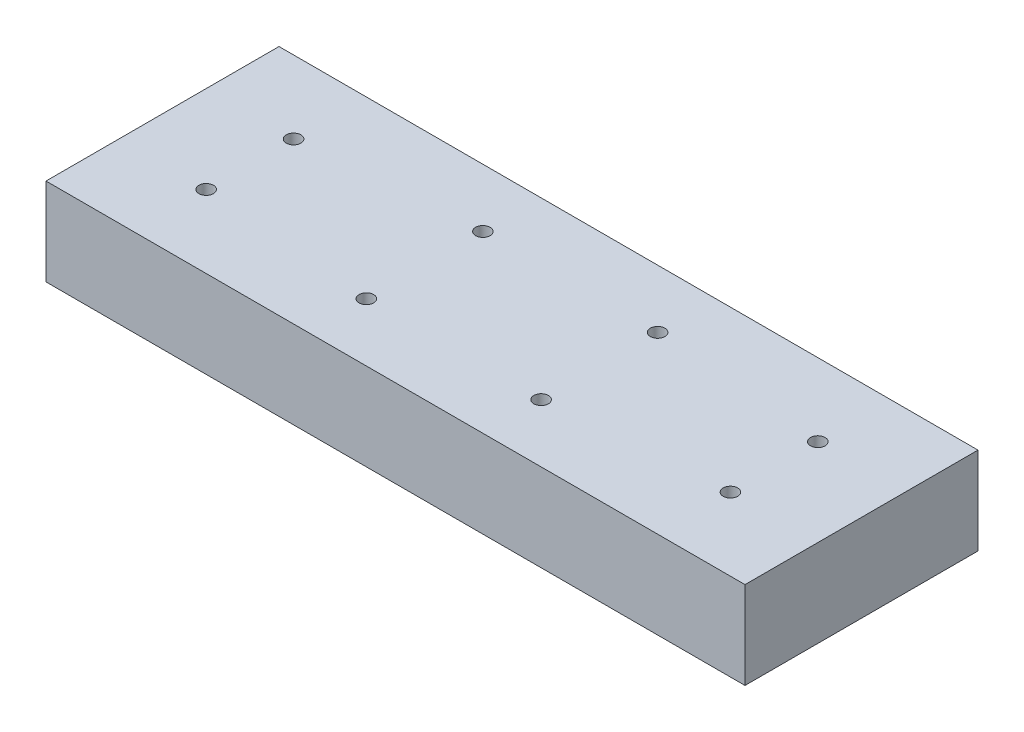
ISO-10303-21;
HEADER;
FILE_DESCRIPTION(('STEP AP214'),'2;1');
FILE_NAME('part.step','',(''),(''),'','','');
FILE_SCHEMA(('AUTOMOTIVE_DESIGN { 1 0 10303 214 1 1 1 1 }'));
ENDSEC;
DATA;
#1=APPLICATION_CONTEXT('core data for automotive mechanical design processes');
#2=APPLICATION_PROTOCOL_DEFINITION('international standard','automotive_design',2000,#1);
#3=PRODUCT_CONTEXT('',#1,'mechanical');
#4=PRODUCT('Part','Part','',(#3));
#5=PRODUCT_RELATED_PRODUCT_CATEGORY('part','',(#4));
#6=PRODUCT_DEFINITION_FORMATION('','',#4);
#7=PRODUCT_DEFINITION_CONTEXT('part definition',#1,'design');
#8=PRODUCT_DEFINITION('design','',#6,#7);
#9=PRODUCT_DEFINITION_SHAPE('','',#8);
#10=(LENGTH_UNIT() NAMED_UNIT(*) SI_UNIT(.MILLI.,.METRE.));
#11=(NAMED_UNIT(*) PLANE_ANGLE_UNIT() SI_UNIT($,.RADIAN.));
#12=(NAMED_UNIT(*) SI_UNIT($,.STERADIAN.) SOLID_ANGLE_UNIT());
#13=UNCERTAINTY_MEASURE_WITH_UNIT(LENGTH_MEASURE(1.E-05),#10,'distance_accuracy_value','');
#14=(GEOMETRIC_REPRESENTATION_CONTEXT(3) GLOBAL_UNCERTAINTY_ASSIGNED_CONTEXT((#13)) GLOBAL_UNIT_ASSIGNED_CONTEXT((#10,
#11,#12)) REPRESENTATION_CONTEXT('',''));
#15=CARTESIAN_POINT('',(0.,0.,0.));
#16=DIRECTION('',(0.,0.,1.));
#17=DIRECTION('',(1.,0.,0.));
#18=AXIS2_PLACEMENT_3D('',#15,#16,#17);
#19=CARTESIAN_POINT('',(133.35,19.05,34.925));
#20=DIRECTION('',(0.,-1.,0.));
#21=DIRECTION('',(0.,0.,-1.));
#22=AXIS2_PLACEMENT_3D('',#19,#20,#21);
#23=CYLINDRICAL_SURFACE('',#22,1.58749999999996);
#24=CARTESIAN_POINT('',(133.35,19.05,34.925));
#25=DIRECTION('',(0.,1.,0.));
#26=DIRECTION('',(0.,0.,1.));
#27=AXIS2_PLACEMENT_3D('',#24,#25,#26);
#28=CIRCLE('',#27,1.58749999999996);
#29=CARTESIAN_POINT('',(133.35,19.05,36.5124999999999));
#30=VERTEX_POINT('',#29);
#31=EDGE_CURVE('E126',#30,#30,#28,.T.);
#32=ORIENTED_EDGE('',*,*,#31,.T.);
#33=EDGE_LOOP('',(#32));
#34=FACE_BOUND('',#33,.T.);
#35=CARTESIAN_POINT('',(133.35,6.35,34.925));
#36=DIRECTION('',(0.,-1.,0.));
#37=DIRECTION('',(0.,0.,-1.));
#38=AXIS2_PLACEMENT_3D('',#35,#36,#37);
#39=CIRCLE('',#38,1.58749999999996);
#40=CARTESIAN_POINT('',(133.35,6.35,33.3375));
#41=VERTEX_POINT('',#40);
#42=EDGE_CURVE('E50',#41,#41,#39,.T.);
#43=ORIENTED_EDGE('',*,*,#42,.T.);
#44=EDGE_LOOP('',(#43));
#45=FACE_BOUND('',#44,.T.);
#46=ADVANCED_FACE('F46',(#34,#45),#23,.F.);
#47=CARTESIAN_POINT('',(133.35,19.05,15.875));
#48=DIRECTION('',(0.,-1.,0.));
#49=DIRECTION('',(0.,0.,-1.));
#50=AXIS2_PLACEMENT_3D('',#47,#48,#49);
#51=CYLINDRICAL_SURFACE('',#50,1.58749999999996);
#52=CARTESIAN_POINT('',(133.35,19.05,15.875));
#53=DIRECTION('',(0.,1.,0.));
#54=DIRECTION('',(0.,0.,1.));
#55=AXIS2_PLACEMENT_3D('',#52,#53,#54);
#56=CIRCLE('',#55,1.58749999999996);
#57=CARTESIAN_POINT('',(133.35,19.05,17.4624999999999));
#58=VERTEX_POINT('',#57);
#59=EDGE_CURVE('E195',#58,#58,#56,.T.);
#60=ORIENTED_EDGE('',*,*,#59,.T.);
#61=EDGE_LOOP('',(#60));
#62=FACE_BOUND('',#61,.T.);
#63=CARTESIAN_POINT('',(133.35,6.35,15.875));
#64=DIRECTION('',(0.,-1.,0.));
#65=DIRECTION('',(0.,0.,-1.));
#66=AXIS2_PLACEMENT_3D('',#63,#64,#65);
#67=CIRCLE('',#66,1.58749999999996);
#68=CARTESIAN_POINT('',(133.35,6.35,14.2875));
#69=VERTEX_POINT('',#68);
#70=EDGE_CURVE('E152',#69,#69,#67,.T.);
#71=ORIENTED_EDGE('',*,*,#70,.T.);
#72=EDGE_LOOP('',(#71));
#73=FACE_BOUND('',#72,.T.);
#74=ADVANCED_FACE('F238',(#62,#73),#51,.F.);
#75=CARTESIAN_POINT('',(95.25,19.05,12.7));
#76=DIRECTION('',(0.,-1.,0.));
#77=DIRECTION('',(0.,0.,-1.));
#78=AXIS2_PLACEMENT_3D('',#75,#76,#77);
#79=CYLINDRICAL_SURFACE('',#78,1.5875);
#80=CARTESIAN_POINT('',(95.25,19.05,12.7));
#81=DIRECTION('',(0.,1.,0.));
#82=DIRECTION('',(0.,0.,1.));
#83=AXIS2_PLACEMENT_3D('',#80,#81,#82);
#84=CIRCLE('',#83,1.5875);
#85=CARTESIAN_POINT('',(95.25,19.05,14.2875));
#86=VERTEX_POINT('',#85);
#87=EDGE_CURVE('E207',#86,#86,#84,.T.);
#88=ORIENTED_EDGE('',*,*,#87,.T.);
#89=EDGE_LOOP('',(#88));
#90=FACE_BOUND('',#89,.T.);
#91=CARTESIAN_POINT('',(95.25,6.35,12.7));
#92=DIRECTION('',(0.,-1.,0.));
#93=DIRECTION('',(0.,0.,-1.));
#94=AXIS2_PLACEMENT_3D('',#91,#92,#93);
#95=CIRCLE('',#94,1.5875);
#96=CARTESIAN_POINT('',(95.25,6.35,11.1125));
#97=VERTEX_POINT('',#96);
#98=EDGE_CURVE('E148',#97,#97,#95,.T.);
#99=ORIENTED_EDGE('',*,*,#98,.T.);
#100=EDGE_LOOP('',(#99));
#101=FACE_BOUND('',#100,.T.);
#102=ADVANCED_FACE('F245',(#90,#101),#79,.F.);
#103=CARTESIAN_POINT('',(95.25,19.05,38.1));
#104=DIRECTION('',(0.,-1.,0.));
#105=DIRECTION('',(0.,0.,-1.));
#106=AXIS2_PLACEMENT_3D('',#103,#104,#105);
#107=CYLINDRICAL_SURFACE('',#106,1.5875);
#108=CARTESIAN_POINT('',(95.25,19.05,38.1));
#109=DIRECTION('',(0.,1.,0.));
#110=DIRECTION('',(0.,0.,1.));
#111=AXIS2_PLACEMENT_3D('',#108,#109,#110);
#112=CIRCLE('',#111,1.5875);
#113=CARTESIAN_POINT('',(95.25,19.05,39.6875));
#114=VERTEX_POINT('',#113);
#115=EDGE_CURVE('E204',#114,#114,#112,.T.);
#116=ORIENTED_EDGE('',*,*,#115,.T.);
#117=EDGE_LOOP('',(#116));
#118=FACE_BOUND('',#117,.T.);
#119=CARTESIAN_POINT('',(95.25,6.35,38.1));
#120=DIRECTION('',(0.,-1.,0.));
#121=DIRECTION('',(0.,0.,-1.));
#122=AXIS2_PLACEMENT_3D('',#119,#120,#121);
#123=CIRCLE('',#122,1.5875);
#124=CARTESIAN_POINT('',(95.25,6.35,36.5125));
#125=VERTEX_POINT('',#124);
#126=EDGE_CURVE('E143',#125,#125,#123,.T.);
#127=ORIENTED_EDGE('',*,*,#126,.T.);
#128=EDGE_LOOP('',(#127));
#129=FACE_BOUND('',#128,.T.);
#130=ADVANCED_FACE('F257',(#118,#129),#107,.F.);
#131=CARTESIAN_POINT('',(57.15,19.05,12.7));
#132=DIRECTION('',(0.,-1.,0.));
#133=DIRECTION('',(0.,0.,-1.));
#134=AXIS2_PLACEMENT_3D('',#131,#132,#133);
#135=CYLINDRICAL_SURFACE('',#134,1.5875);
#136=CARTESIAN_POINT('',(57.15,19.05,12.7));
#137=DIRECTION('',(0.,1.,0.));
#138=DIRECTION('',(0.,0.,1.));
#139=AXIS2_PLACEMENT_3D('',#136,#137,#138);
#140=CIRCLE('',#139,1.5875);
#141=CARTESIAN_POINT('',(57.15,19.05,14.2875));
#142=VERTEX_POINT('',#141);
#143=EDGE_CURVE('E117',#142,#142,#140,.T.);
#144=ORIENTED_EDGE('',*,*,#143,.T.);
#145=EDGE_LOOP('',(#144));
#146=FACE_BOUND('',#145,.T.);
#147=CARTESIAN_POINT('',(57.15,6.35,12.7));
#148=DIRECTION('',(0.,-1.,0.));
#149=DIRECTION('',(0.,0.,-1.));
#150=AXIS2_PLACEMENT_3D('',#147,#148,#149);
#151=CIRCLE('',#150,1.5875);
#152=CARTESIAN_POINT('',(57.15,6.35,11.1125));
#153=VERTEX_POINT('',#152);
#154=EDGE_CURVE('E138',#153,#153,#151,.T.);
#155=ORIENTED_EDGE('',*,*,#154,.T.);
#156=EDGE_LOOP('',(#155));
#157=FACE_BOUND('',#156,.T.);
#158=ADVANCED_FACE('F216',(#146,#157),#135,.F.);
#159=CARTESIAN_POINT('',(57.15,19.05,38.1));
#160=DIRECTION('',(0.,-1.,0.));
#161=DIRECTION('',(0.,0.,-1.));
#162=AXIS2_PLACEMENT_3D('',#159,#160,#161);
#163=CYLINDRICAL_SURFACE('',#162,1.5875);
#164=CARTESIAN_POINT('',(57.15,19.05,38.1));
#165=DIRECTION('',(0.,1.,0.));
#166=DIRECTION('',(0.,0.,1.));
#167=AXIS2_PLACEMENT_3D('',#164,#165,#166);
#168=CIRCLE('',#167,1.5875);
#169=CARTESIAN_POINT('',(57.15,19.05,39.6875));
#170=VERTEX_POINT('',#169);
#171=EDGE_CURVE('E210',#170,#170,#168,.T.);
#172=ORIENTED_EDGE('',*,*,#171,.T.);
#173=EDGE_LOOP('',(#172));
#174=FACE_BOUND('',#173,.T.);
#175=CARTESIAN_POINT('',(57.15,6.35,38.1));
#176=DIRECTION('',(0.,-1.,0.));
#177=DIRECTION('',(0.,0.,-1.));
#178=AXIS2_PLACEMENT_3D('',#175,#176,#177);
#179=CIRCLE('',#178,1.5875);
#180=CARTESIAN_POINT('',(57.15,6.35,36.5125));
#181=VERTEX_POINT('',#180);
#182=EDGE_CURVE('E133',#181,#181,#179,.T.);
#183=ORIENTED_EDGE('',*,*,#182,.T.);
#184=EDGE_LOOP('',(#183));
#185=FACE_BOUND('',#184,.T.);
#186=ADVANCED_FACE('F255',(#174,#185),#163,.F.);
#187=CARTESIAN_POINT('',(19.05,19.05,15.875));
#188=DIRECTION('',(0.,-1.,0.));
#189=DIRECTION('',(0.,0.,-1.));
#190=AXIS2_PLACEMENT_3D('',#187,#188,#189);
#191=CYLINDRICAL_SURFACE('',#190,1.5875);
#192=CARTESIAN_POINT('',(19.05,19.05,15.875));
#193=DIRECTION('',(0.,1.,0.));
#194=DIRECTION('',(0.,0.,1.));
#195=AXIS2_PLACEMENT_3D('',#192,#193,#194);
#196=CIRCLE('',#195,1.5875);
#197=CARTESIAN_POINT('',(19.05,19.05,17.4625));
#198=VERTEX_POINT('',#197);
#199=EDGE_CURVE('E201',#198,#198,#196,.T.);
#200=ORIENTED_EDGE('',*,*,#199,.T.);
#201=EDGE_LOOP('',(#200));
#202=FACE_BOUND('',#201,.T.);
#203=CARTESIAN_POINT('',(19.05,6.35,15.875));
#204=DIRECTION('',(0.,-1.,0.));
#205=DIRECTION('',(0.,0.,-1.));
#206=AXIS2_PLACEMENT_3D('',#203,#204,#205);
#207=CIRCLE('',#206,1.5875);
#208=CARTESIAN_POINT('',(19.05,6.35,14.2875));
#209=VERTEX_POINT('',#208);
#210=EDGE_CURVE('E128',#209,#209,#207,.T.);
#211=ORIENTED_EDGE('',*,*,#210,.T.);
#212=EDGE_LOOP('',(#211));
#213=FACE_BOUND('',#212,.T.);
#214=ADVANCED_FACE('F231',(#202,#213),#191,.F.);
#215=CARTESIAN_POINT('',(19.05,19.05,34.925));
#216=DIRECTION('',(0.,-1.,0.));
#217=DIRECTION('',(0.,0.,-1.));
#218=AXIS2_PLACEMENT_3D('',#215,#216,#217);
#219=CYLINDRICAL_SURFACE('',#218,1.5875);
#220=CARTESIAN_POINT('',(19.05,19.05,34.925));
#221=DIRECTION('',(0.,1.,0.));
#222=DIRECTION('',(0.,0.,1.));
#223=AXIS2_PLACEMENT_3D('',#220,#221,#222);
#224=CIRCLE('',#223,1.5875);
#225=CARTESIAN_POINT('',(19.05,19.05,36.5125));
#226=VERTEX_POINT('',#225);
#227=EDGE_CURVE('E198',#226,#226,#224,.T.);
#228=ORIENTED_EDGE('',*,*,#227,.T.);
#229=EDGE_LOOP('',(#228));
#230=FACE_BOUND('',#229,.T.);
#231=CARTESIAN_POINT('',(19.05,6.35,34.925));
#232=DIRECTION('',(0.,-1.,0.));
#233=DIRECTION('',(0.,0.,-1.));
#234=AXIS2_PLACEMENT_3D('',#231,#232,#233);
#235=CIRCLE('',#234,1.5875);
#236=CARTESIAN_POINT('',(19.05,6.35,33.3375));
#237=VERTEX_POINT('',#236);
#238=EDGE_CURVE('E123',#237,#237,#235,.T.);
#239=ORIENTED_EDGE('',*,*,#238,.T.);
#240=EDGE_LOOP('',(#239));
#241=FACE_BOUND('',#240,.T.);
#242=ADVANCED_FACE('F221',(#230,#241),#219,.F.);
#243=CARTESIAN_POINT('',(0.,19.05,0.));
#244=DIRECTION('',(0.,1.,0.));
#245=DIRECTION('',(0.,0.,1.));
#246=AXIS2_PLACEMENT_3D('',#243,#244,#245);
#247=PLANE('',#246);
#248=ORIENTED_EDGE('',*,*,#59,.F.);
#249=EDGE_LOOP('',(#248));
#250=FACE_BOUND('',#249,.T.);
#251=ORIENTED_EDGE('',*,*,#199,.F.);
#252=EDGE_LOOP('',(#251));
#253=FACE_BOUND('',#252,.T.);
#254=ORIENTED_EDGE('',*,*,#87,.F.);
#255=EDGE_LOOP('',(#254));
#256=FACE_BOUND('',#255,.T.);
#257=ORIENTED_EDGE('',*,*,#143,.F.);
#258=EDGE_LOOP('',(#257));
#259=FACE_BOUND('',#258,.T.);
#260=DIRECTION('',(0.,0.,1.));
#261=VECTOR('',#260,1.);
#262=CARTESIAN_POINT('',(0.,19.05,0.));
#263=LINE('',#262,#261);
#264=CARTESIAN_POINT('',(0.,19.05,0.));
#265=VERTEX_POINT('',#264);
#266=CARTESIAN_POINT('',(0.,19.05,50.8));
#267=VERTEX_POINT('',#266);
#268=EDGE_CURVE('E101',#265,#267,#263,.T.);
#269=ORIENTED_EDGE('',*,*,#268,.T.);
#270=DIRECTION('',(1.,0.,0.));
#271=VECTOR('',#270,1.);
#272=CARTESIAN_POINT('',(0.,19.05,50.8));
#273=LINE('',#272,#271);
#274=CARTESIAN_POINT('',(152.4,19.05,50.8));
#275=VERTEX_POINT('',#274);
#276=EDGE_CURVE('E95',#267,#275,#273,.T.);
#277=ORIENTED_EDGE('',*,*,#276,.T.);
#278=DIRECTION('',(0.,0.,-1.));
#279=VECTOR('',#278,1.);
#280=CARTESIAN_POINT('',(152.4,19.05,0.));
#281=LINE('',#280,#279);
#282=CARTESIAN_POINT('',(152.4,19.05,0.));
#283=VERTEX_POINT('',#282);
#284=EDGE_CURVE('E99',#275,#283,#281,.T.);
#285=ORIENTED_EDGE('',*,*,#284,.T.);
#286=DIRECTION('',(-1.,0.,0.));
#287=VECTOR('',#286,1.);
#288=CARTESIAN_POINT('',(0.,19.05,0.));
#289=LINE('',#288,#287);
#290=EDGE_CURVE('E65',#283,#265,#289,.T.);
#291=ORIENTED_EDGE('',*,*,#290,.T.);
#292=EDGE_LOOP('',(#269,#277,#285,#291));
#293=FACE_BOUND('',#292,.T.);
#294=ORIENTED_EDGE('',*,*,#171,.F.);
#295=EDGE_LOOP('',(#294));
#296=FACE_BOUND('',#295,.T.);
#297=ORIENTED_EDGE('',*,*,#115,.F.);
#298=EDGE_LOOP('',(#297));
#299=FACE_BOUND('',#298,.T.);
#300=ORIENTED_EDGE('',*,*,#227,.F.);
#301=EDGE_LOOP('',(#300));
#302=FACE_BOUND('',#301,.T.);
#303=ORIENTED_EDGE('',*,*,#31,.F.);
#304=EDGE_LOOP('',(#303));
#305=FACE_BOUND('',#304,.T.);
#306=ADVANCED_FACE('F96',(#250,#253,#256,#259,#293,#296,#299,#302,#305),#247,.T.);
#307=CARTESIAN_POINT('',(0.,0.,0.));
#308=DIRECTION('',(0.,1.,0.));
#309=DIRECTION('',(0.,0.,1.));
#310=AXIS2_PLACEMENT_3D('',#307,#308,#309);
#311=PLANE('',#310);
#312=CARTESIAN_POINT('',(133.35,0.,34.925));
#313=DIRECTION('',(0.,-1.,0.));
#314=DIRECTION('',(0.,0.,-1.));
#315=AXIS2_PLACEMENT_3D('',#312,#313,#314);
#316=CIRCLE('',#315,5.55625);
#317=CARTESIAN_POINT('',(133.35,0.,29.36875));
#318=VERTEX_POINT('',#317);
#319=EDGE_CURVE('E168',#318,#318,#316,.T.);
#320=ORIENTED_EDGE('',*,*,#319,.F.);
#321=EDGE_LOOP('',(#320));
#322=FACE_BOUND('',#321,.T.);
#323=CARTESIAN_POINT('',(133.35,0.,15.875));
#324=DIRECTION('',(0.,-1.,0.));
#325=DIRECTION('',(0.,0.,-1.));
#326=AXIS2_PLACEMENT_3D('',#323,#324,#325);
#327=CIRCLE('',#326,5.55625);
#328=CARTESIAN_POINT('',(133.35,0.,10.31875));
#329=VERTEX_POINT('',#328);
#330=EDGE_CURVE('E161',#329,#329,#327,.T.);
#331=ORIENTED_EDGE('',*,*,#330,.F.);
#332=EDGE_LOOP('',(#331));
#333=FACE_BOUND('',#332,.T.);
#334=CARTESIAN_POINT('',(95.25,0.,12.7));
#335=DIRECTION('',(0.,-1.,0.));
#336=DIRECTION('',(0.,0.,-1.));
#337=AXIS2_PLACEMENT_3D('',#334,#335,#336);
#338=CIRCLE('',#337,5.55625);
#339=CARTESIAN_POINT('',(95.25,0.,7.14375));
#340=VERTEX_POINT('',#339);
#341=EDGE_CURVE('E154',#340,#340,#338,.T.);
#342=ORIENTED_EDGE('',*,*,#341,.F.);
#343=EDGE_LOOP('',(#342));
#344=FACE_BOUND('',#343,.T.);
#345=CARTESIAN_POINT('',(95.25,0.,38.1));
#346=DIRECTION('',(0.,-1.,0.));
#347=DIRECTION('',(0.,0.,-1.));
#348=AXIS2_PLACEMENT_3D('',#345,#346,#347);
#349=CIRCLE('',#348,5.55625);
#350=CARTESIAN_POINT('',(95.25,0.,32.54375));
#351=VERTEX_POINT('',#350);
#352=EDGE_CURVE('E150',#351,#351,#349,.T.);
#353=ORIENTED_EDGE('',*,*,#352,.F.);
#354=EDGE_LOOP('',(#353));
#355=FACE_BOUND('',#354,.T.);
#356=CARTESIAN_POINT('',(57.15,0.,12.7));
#357=DIRECTION('',(0.,-1.,0.));
#358=DIRECTION('',(0.,0.,-1.));
#359=AXIS2_PLACEMENT_3D('',#356,#357,#358);
#360=CIRCLE('',#359,5.55625);
#361=CARTESIAN_POINT('',(57.15,0.,7.14375));
#362=VERTEX_POINT('',#361);
#363=EDGE_CURVE('E146',#362,#362,#360,.T.);
#364=ORIENTED_EDGE('',*,*,#363,.F.);
#365=EDGE_LOOP('',(#364));
#366=FACE_BOUND('',#365,.T.);
#367=CARTESIAN_POINT('',(57.15,0.,38.1));
#368=DIRECTION('',(0.,-1.,0.));
#369=DIRECTION('',(0.,0.,-1.));
#370=AXIS2_PLACEMENT_3D('',#367,#368,#369);
#371=CIRCLE('',#370,5.55625);
#372=CARTESIAN_POINT('',(57.15,0.,32.54375));
#373=VERTEX_POINT('',#372);
#374=EDGE_CURVE('E141',#373,#373,#371,.T.);
#375=ORIENTED_EDGE('',*,*,#374,.F.);
#376=EDGE_LOOP('',(#375));
#377=FACE_BOUND('',#376,.T.);
#378=CARTESIAN_POINT('',(19.05,0.,15.875));
#379=DIRECTION('',(0.,-1.,0.));
#380=DIRECTION('',(0.,0.,-1.));
#381=AXIS2_PLACEMENT_3D('',#378,#379,#380);
#382=CIRCLE('',#381,5.55625);
#383=CARTESIAN_POINT('',(19.05,0.,10.31875));
#384=VERTEX_POINT('',#383);
#385=EDGE_CURVE('E136',#384,#384,#382,.T.);
#386=ORIENTED_EDGE('',*,*,#385,.F.);
#387=EDGE_LOOP('',(#386));
#388=FACE_BOUND('',#387,.T.);
#389=CARTESIAN_POINT('',(19.05,0.,34.925));
#390=DIRECTION('',(0.,-1.,0.));
#391=DIRECTION('',(0.,0.,-1.));
#392=AXIS2_PLACEMENT_3D('',#389,#390,#391);
#393=CIRCLE('',#392,5.55625);
#394=CARTESIAN_POINT('',(19.05,0.,29.36875));
#395=VERTEX_POINT('',#394);
#396=EDGE_CURVE('E131',#395,#395,#393,.T.);
#397=ORIENTED_EDGE('',*,*,#396,.F.);
#398=EDGE_LOOP('',(#397));
#399=FACE_BOUND('',#398,.T.);
#400=DIRECTION('',(0.,0.,1.));
#401=VECTOR('',#400,1.);
#402=CARTESIAN_POINT('',(0.,0.,0.));
#403=LINE('',#402,#401);
#404=CARTESIAN_POINT('',(0.,0.,0.));
#405=VERTEX_POINT('',#404);
#406=CARTESIAN_POINT('',(0.,0.,50.8));
#407=VERTEX_POINT('',#406);
#408=EDGE_CURVE('E114',#405,#407,#403,.T.);
#409=ORIENTED_EDGE('',*,*,#408,.F.);
#410=DIRECTION('',(-1.,0.,0.));
#411=VECTOR('',#410,1.);
#412=CARTESIAN_POINT('',(0.,0.,0.));
#413=LINE('',#412,#411);
#414=CARTESIAN_POINT('',(152.4,0.,0.));
#415=VERTEX_POINT('',#414);
#416=EDGE_CURVE('E88',#415,#405,#413,.T.);
#417=ORIENTED_EDGE('',*,*,#416,.F.);
#418=DIRECTION('',(0.,0.,-1.));
#419=VECTOR('',#418,1.);
#420=CARTESIAN_POINT('',(152.4,0.,0.));
#421=LINE('',#420,#419);
#422=CARTESIAN_POINT('',(152.4,0.,50.8));
#423=VERTEX_POINT('',#422);
#424=EDGE_CURVE('E82',#423,#415,#421,.T.);
#425=ORIENTED_EDGE('',*,*,#424,.F.);
#426=DIRECTION('',(1.,0.,0.));
#427=VECTOR('',#426,1.);
#428=CARTESIAN_POINT('',(0.,0.,50.8));
#429=LINE('',#428,#427);
#430=EDGE_CURVE('E105',#407,#423,#429,.T.);
#431=ORIENTED_EDGE('',*,*,#430,.F.);
#432=EDGE_LOOP('',(#409,#417,#425,#431));
#433=FACE_BOUND('',#432,.T.);
#434=ADVANCED_FACE('F220',(#322,#333,#344,#355,#366,#377,#388,#399,#433),#311,.F.);
#435=CARTESIAN_POINT('',(0.,19.05,0.));
#436=DIRECTION('',(1.,0.,0.));
#437=DIRECTION('',(0.,0.,-1.));
#438=AXIS2_PLACEMENT_3D('',#435,#436,#437);
#439=PLANE('',#438);
#440=ORIENTED_EDGE('',*,*,#408,.T.);
#441=DIRECTION('',(0.,-1.,0.));
#442=VECTOR('',#441,1.);
#443=CARTESIAN_POINT('',(0.,19.05,50.8));
#444=LINE('',#443,#442);
#445=EDGE_CURVE('E13',#267,#407,#444,.T.);
#446=ORIENTED_EDGE('',*,*,#445,.F.);
#447=ORIENTED_EDGE('',*,*,#268,.F.);
#448=DIRECTION('',(0.,-1.,0.));
#449=VECTOR('',#448,1.);
#450=CARTESIAN_POINT('',(0.,19.05,0.));
#451=LINE('',#450,#449);
#452=EDGE_CURVE('E110',#265,#405,#451,.T.);
#453=ORIENTED_EDGE('',*,*,#452,.T.);
#454=EDGE_LOOP('',(#440,#446,#447,#453));
#455=FACE_BOUND('',#454,.T.);
#456=ADVANCED_FACE('F48',(#455),#439,.F.);
#457=CARTESIAN_POINT('',(0.,19.05,50.8));
#458=DIRECTION('',(0.,0.,-1.));
#459=DIRECTION('',(-1.,0.,0.));
#460=AXIS2_PLACEMENT_3D('',#457,#458,#459);
#461=PLANE('',#460);
#462=ORIENTED_EDGE('',*,*,#430,.T.);
#463=DIRECTION('',(0.,-1.,0.));
#464=VECTOR('',#463,1.);
#465=CARTESIAN_POINT('',(152.4,19.05,50.8));
#466=LINE('',#465,#464);
#467=EDGE_CURVE('E56',#275,#423,#466,.T.);
#468=ORIENTED_EDGE('',*,*,#467,.F.);
#469=ORIENTED_EDGE('',*,*,#276,.F.);
#470=ORIENTED_EDGE('',*,*,#445,.T.);
#471=EDGE_LOOP('',(#462,#468,#469,#470));
#472=FACE_BOUND('',#471,.T.);
#473=ADVANCED_FACE('F104',(#472),#461,.F.);
#474=CARTESIAN_POINT('',(152.4,19.05,0.));
#475=DIRECTION('',(-1.,0.,0.));
#476=DIRECTION('',(0.,0.,1.));
#477=AXIS2_PLACEMENT_3D('',#474,#475,#476);
#478=PLANE('',#477);
#479=ORIENTED_EDGE('',*,*,#424,.T.);
#480=DIRECTION('',(0.,-1.,0.));
#481=VECTOR('',#480,1.);
#482=CARTESIAN_POINT('',(152.4,19.05,0.));
#483=LINE('',#482,#481);
#484=EDGE_CURVE('E106',#283,#415,#483,.T.);
#485=ORIENTED_EDGE('',*,*,#484,.F.);
#486=ORIENTED_EDGE('',*,*,#284,.F.);
#487=ORIENTED_EDGE('',*,*,#467,.T.);
#488=EDGE_LOOP('',(#479,#485,#486,#487));
#489=FACE_BOUND('',#488,.T.);
#490=ADVANCED_FACE('F108',(#489),#478,.F.);
#491=CARTESIAN_POINT('',(0.,19.05,0.));
#492=DIRECTION('',(0.,0.,1.));
#493=DIRECTION('',(1.,0.,0.));
#494=AXIS2_PLACEMENT_3D('',#491,#492,#493);
#495=PLANE('',#494);
#496=ORIENTED_EDGE('',*,*,#416,.T.);
#497=ORIENTED_EDGE('',*,*,#452,.F.);
#498=ORIENTED_EDGE('',*,*,#290,.F.);
#499=ORIENTED_EDGE('',*,*,#484,.T.);
#500=EDGE_LOOP('',(#496,#497,#498,#499));
#501=FACE_BOUND('',#500,.T.);
#502=ADVANCED_FACE('F300',(#501),#495,.F.);
#503=CARTESIAN_POINT('',(19.05,6.35,34.925));
#504=DIRECTION('',(0.,-1.,0.));
#505=DIRECTION('',(0.,0.,-1.));
#506=AXIS2_PLACEMENT_3D('',#503,#504,#505);
#507=CYLINDRICAL_SURFACE('',#506,5.55625);
#508=CARTESIAN_POINT('',(19.05,6.35,34.925));
#509=DIRECTION('',(0.,-1.,0.));
#510=DIRECTION('',(0.,0.,-1.));
#511=AXIS2_PLACEMENT_3D('',#508,#509,#510);
#512=CIRCLE('',#511,5.55625);
#513=CARTESIAN_POINT('',(19.05,6.35,29.36875));
#514=VERTEX_POINT('',#513);
#515=EDGE_CURVE('E127',#514,#514,#512,.T.);
#516=ORIENTED_EDGE('',*,*,#515,.F.);
#517=EDGE_LOOP('',(#516));
#518=FACE_BOUND('',#517,.T.);
#519=ORIENTED_EDGE('',*,*,#396,.T.);
#520=EDGE_LOOP('',(#519));
#521=FACE_BOUND('',#520,.T.);
#522=ADVANCED_FACE('F250',(#518,#521),#507,.F.);
#523=CARTESIAN_POINT('',(19.05,6.35,34.925));
#524=DIRECTION('',(0.,-1.,0.));
#525=DIRECTION('',(0.,0.,-1.));
#526=AXIS2_PLACEMENT_3D('',#523,#524,#525);
#527=PLANE('',#526);
#528=ORIENTED_EDGE('',*,*,#238,.F.);
#529=EDGE_LOOP('',(#528));
#530=FACE_BOUND('',#529,.T.);
#531=ORIENTED_EDGE('',*,*,#515,.T.);
#532=EDGE_LOOP('',(#531));
#533=FACE_BOUND('',#532,.T.);
#534=ADVANCED_FACE('F299',(#530,#533),#527,.T.);
#535=CARTESIAN_POINT('',(19.05,6.35,15.875));
#536=DIRECTION('',(0.,-1.,0.));
#537=DIRECTION('',(0.,0.,-1.));
#538=AXIS2_PLACEMENT_3D('',#535,#536,#537);
#539=CYLINDRICAL_SURFACE('',#538,5.55625);
#540=CARTESIAN_POINT('',(19.05,6.35,15.875));
#541=DIRECTION('',(0.,-1.,0.));
#542=DIRECTION('',(0.,0.,-1.));
#543=AXIS2_PLACEMENT_3D('',#540,#541,#542);
#544=CIRCLE('',#543,5.55625);
#545=CARTESIAN_POINT('',(19.05,6.35,10.31875));
#546=VERTEX_POINT('',#545);
#547=EDGE_CURVE('E132',#546,#546,#544,.T.);
#548=ORIENTED_EDGE('',*,*,#547,.F.);
#549=EDGE_LOOP('',(#548));
#550=FACE_BOUND('',#549,.T.);
#551=ORIENTED_EDGE('',*,*,#385,.T.);
#552=EDGE_LOOP('',(#551));
#553=FACE_BOUND('',#552,.T.);
#554=ADVANCED_FACE('F310',(#550,#553),#539,.F.);
#555=CARTESIAN_POINT('',(19.05,6.35,15.875));
#556=DIRECTION('',(0.,-1.,0.));
#557=DIRECTION('',(0.,0.,-1.));
#558=AXIS2_PLACEMENT_3D('',#555,#556,#557);
#559=PLANE('',#558);
#560=ORIENTED_EDGE('',*,*,#210,.F.);
#561=EDGE_LOOP('',(#560));
#562=FACE_BOUND('',#561,.T.);
#563=ORIENTED_EDGE('',*,*,#547,.T.);
#564=EDGE_LOOP('',(#563));
#565=FACE_BOUND('',#564,.T.);
#566=ADVANCED_FACE('F319',(#562,#565),#559,.T.);
#567=CARTESIAN_POINT('',(57.15,6.35,38.1));
#568=DIRECTION('',(0.,-1.,0.));
#569=DIRECTION('',(0.,0.,-1.));
#570=AXIS2_PLACEMENT_3D('',#567,#568,#569);
#571=CYLINDRICAL_SURFACE('',#570,5.55625);
#572=CARTESIAN_POINT('',(57.15,6.35,38.1));
#573=DIRECTION('',(0.,-1.,0.));
#574=DIRECTION('',(0.,0.,-1.));
#575=AXIS2_PLACEMENT_3D('',#572,#573,#574);
#576=CIRCLE('',#575,5.55625);
#577=CARTESIAN_POINT('',(57.15,6.35,32.54375));
#578=VERTEX_POINT('',#577);
#579=EDGE_CURVE('E137',#578,#578,#576,.T.);
#580=ORIENTED_EDGE('',*,*,#579,.F.);
#581=EDGE_LOOP('',(#580));
#582=FACE_BOUND('',#581,.T.);
#583=ORIENTED_EDGE('',*,*,#374,.T.);
#584=EDGE_LOOP('',(#583));
#585=FACE_BOUND('',#584,.T.);
#586=ADVANCED_FACE('F329',(#582,#585),#571,.F.);
#587=CARTESIAN_POINT('',(57.15,6.35,38.1));
#588=DIRECTION('',(0.,-1.,0.));
#589=DIRECTION('',(0.,0.,-1.));
#590=AXIS2_PLACEMENT_3D('',#587,#588,#589);
#591=PLANE('',#590);
#592=ORIENTED_EDGE('',*,*,#182,.F.);
#593=EDGE_LOOP('',(#592));
#594=FACE_BOUND('',#593,.T.);
#595=ORIENTED_EDGE('',*,*,#579,.T.);
#596=EDGE_LOOP('',(#595));
#597=FACE_BOUND('',#596,.T.);
#598=ADVANCED_FACE('F339',(#594,#597),#591,.T.);
#599=CARTESIAN_POINT('',(57.15,6.35,12.7));
#600=DIRECTION('',(0.,-1.,0.));
#601=DIRECTION('',(0.,0.,-1.));
#602=AXIS2_PLACEMENT_3D('',#599,#600,#601);
#603=CYLINDRICAL_SURFACE('',#602,5.55625);
#604=CARTESIAN_POINT('',(57.15,6.35,12.7));
#605=DIRECTION('',(0.,-1.,0.));
#606=DIRECTION('',(0.,0.,-1.));
#607=AXIS2_PLACEMENT_3D('',#604,#605,#606);
#608=CIRCLE('',#607,5.55625);
#609=CARTESIAN_POINT('',(57.15,6.35,7.14375));
#610=VERTEX_POINT('',#609);
#611=EDGE_CURVE('E142',#610,#610,#608,.T.);
#612=ORIENTED_EDGE('',*,*,#611,.F.);
#613=EDGE_LOOP('',(#612));
#614=FACE_BOUND('',#613,.T.);
#615=ORIENTED_EDGE('',*,*,#363,.T.);
#616=EDGE_LOOP('',(#615));
#617=FACE_BOUND('',#616,.T.);
#618=ADVANCED_FACE('F349',(#614,#617),#603,.F.);
#619=CARTESIAN_POINT('',(57.15,6.35,12.7));
#620=DIRECTION('',(0.,-1.,0.));
#621=DIRECTION('',(0.,0.,-1.));
#622=AXIS2_PLACEMENT_3D('',#619,#620,#621);
#623=PLANE('',#622);
#624=ORIENTED_EDGE('',*,*,#154,.F.);
#625=EDGE_LOOP('',(#624));
#626=FACE_BOUND('',#625,.T.);
#627=ORIENTED_EDGE('',*,*,#611,.T.);
#628=EDGE_LOOP('',(#627));
#629=FACE_BOUND('',#628,.T.);
#630=ADVANCED_FACE('F359',(#626,#629),#623,.T.);
#631=CARTESIAN_POINT('',(95.25,6.35,38.1));
#632=DIRECTION('',(0.,-1.,0.));
#633=DIRECTION('',(0.,0.,-1.));
#634=AXIS2_PLACEMENT_3D('',#631,#632,#633);
#635=CYLINDRICAL_SURFACE('',#634,5.55625);
#636=CARTESIAN_POINT('',(95.25,6.35,38.1));
#637=DIRECTION('',(0.,-1.,0.));
#638=DIRECTION('',(0.,0.,-1.));
#639=AXIS2_PLACEMENT_3D('',#636,#637,#638);
#640=CIRCLE('',#639,5.55625);
#641=CARTESIAN_POINT('',(95.25,6.35,32.54375));
#642=VERTEX_POINT('',#641);
#643=EDGE_CURVE('E147',#642,#642,#640,.T.);
#644=ORIENTED_EDGE('',*,*,#643,.F.);
#645=EDGE_LOOP('',(#644));
#646=FACE_BOUND('',#645,.T.);
#647=ORIENTED_EDGE('',*,*,#352,.T.);
#648=EDGE_LOOP('',(#647));
#649=FACE_BOUND('',#648,.T.);
#650=ADVANCED_FACE('F369',(#646,#649),#635,.F.);
#651=CARTESIAN_POINT('',(95.25,6.35,38.1));
#652=DIRECTION('',(0.,-1.,0.));
#653=DIRECTION('',(0.,0.,-1.));
#654=AXIS2_PLACEMENT_3D('',#651,#652,#653);
#655=PLANE('',#654);
#656=ORIENTED_EDGE('',*,*,#126,.F.);
#657=EDGE_LOOP('',(#656));
#658=FACE_BOUND('',#657,.T.);
#659=ORIENTED_EDGE('',*,*,#643,.T.);
#660=EDGE_LOOP('',(#659));
#661=FACE_BOUND('',#660,.T.);
#662=ADVANCED_FACE('F379',(#658,#661),#655,.T.);
#663=CARTESIAN_POINT('',(95.25,6.35,12.7));
#664=DIRECTION('',(0.,-1.,0.));
#665=DIRECTION('',(0.,0.,-1.));
#666=AXIS2_PLACEMENT_3D('',#663,#664,#665);
#667=CYLINDRICAL_SURFACE('',#666,5.55625);
#668=CARTESIAN_POINT('',(95.25,6.35,12.7));
#669=DIRECTION('',(0.,-1.,0.));
#670=DIRECTION('',(0.,0.,-1.));
#671=AXIS2_PLACEMENT_3D('',#668,#669,#670);
#672=CIRCLE('',#671,5.55625);
#673=CARTESIAN_POINT('',(95.25,6.35,7.14375));
#674=VERTEX_POINT('',#673);
#675=EDGE_CURVE('E151',#674,#674,#672,.T.);
#676=ORIENTED_EDGE('',*,*,#675,.F.);
#677=EDGE_LOOP('',(#676));
#678=FACE_BOUND('',#677,.T.);
#679=ORIENTED_EDGE('',*,*,#341,.T.);
#680=EDGE_LOOP('',(#679));
#681=FACE_BOUND('',#680,.T.);
#682=ADVANCED_FACE('F389',(#678,#681),#667,.F.);
#683=CARTESIAN_POINT('',(95.25,6.35,12.7));
#684=DIRECTION('',(0.,-1.,0.));
#685=DIRECTION('',(0.,0.,-1.));
#686=AXIS2_PLACEMENT_3D('',#683,#684,#685);
#687=PLANE('',#686);
#688=ORIENTED_EDGE('',*,*,#98,.F.);
#689=EDGE_LOOP('',(#688));
#690=FACE_BOUND('',#689,.T.);
#691=ORIENTED_EDGE('',*,*,#675,.T.);
#692=EDGE_LOOP('',(#691));
#693=FACE_BOUND('',#692,.T.);
#694=ADVANCED_FACE('F399',(#690,#693),#687,.T.);
#695=CARTESIAN_POINT('',(133.35,6.35,15.875));
#696=DIRECTION('',(0.,-1.,0.));
#697=DIRECTION('',(0.,0.,-1.));
#698=AXIS2_PLACEMENT_3D('',#695,#696,#697);
#699=CYLINDRICAL_SURFACE('',#698,5.55625);
#700=CARTESIAN_POINT('',(133.35,6.35,15.875));
#701=DIRECTION('',(0.,-1.,0.));
#702=DIRECTION('',(0.,0.,-1.));
#703=AXIS2_PLACEMENT_3D('',#700,#701,#702);
#704=CIRCLE('',#703,5.55625);
#705=CARTESIAN_POINT('',(133.35,6.35,10.31875));
#706=VERTEX_POINT('',#705);
#707=EDGE_CURVE('E155',#706,#706,#704,.T.);
#708=ORIENTED_EDGE('',*,*,#707,.F.);
#709=EDGE_LOOP('',(#708));
#710=FACE_BOUND('',#709,.T.);
#711=ORIENTED_EDGE('',*,*,#330,.T.);
#712=EDGE_LOOP('',(#711));
#713=FACE_BOUND('',#712,.T.);
#714=ADVANCED_FACE('F409',(#710,#713),#699,.F.);
#715=CARTESIAN_POINT('',(133.35,6.35,15.875));
#716=DIRECTION('',(0.,-1.,0.));
#717=DIRECTION('',(0.,0.,-1.));
#718=AXIS2_PLACEMENT_3D('',#715,#716,#717);
#719=PLANE('',#718);
#720=ORIENTED_EDGE('',*,*,#70,.F.);
#721=EDGE_LOOP('',(#720));
#722=FACE_BOUND('',#721,.T.);
#723=ORIENTED_EDGE('',*,*,#707,.T.);
#724=EDGE_LOOP('',(#723));
#725=FACE_BOUND('',#724,.T.);
#726=ADVANCED_FACE('F419',(#722,#725),#719,.T.);
#727=CARTESIAN_POINT('',(133.35,6.35,34.925));
#728=DIRECTION('',(0.,-1.,0.));
#729=DIRECTION('',(0.,0.,-1.));
#730=AXIS2_PLACEMENT_3D('',#727,#728,#729);
#731=CYLINDRICAL_SURFACE('',#730,5.55625);
#732=CARTESIAN_POINT('',(133.35,6.35,34.925));
#733=DIRECTION('',(0.,-1.,0.));
#734=DIRECTION('',(0.,0.,-1.));
#735=AXIS2_PLACEMENT_3D('',#732,#733,#734);
#736=CIRCLE('',#735,5.55625);
#737=CARTESIAN_POINT('',(133.35,6.35,29.36875));
#738=VERTEX_POINT('',#737);
#739=EDGE_CURVE('E458',#738,#738,#736,.T.);
#740=ORIENTED_EDGE('',*,*,#739,.F.);
#741=EDGE_LOOP('',(#740));
#742=FACE_BOUND('',#741,.T.);
#743=ORIENTED_EDGE('',*,*,#319,.T.);
#744=EDGE_LOOP('',(#743));
#745=FACE_BOUND('',#744,.T.);
#746=ADVANCED_FACE('F429',(#742,#745),#731,.F.);
#747=CARTESIAN_POINT('',(133.35,6.35,34.925));
#748=DIRECTION('',(0.,-1.,0.));
#749=DIRECTION('',(0.,0.,-1.));
#750=AXIS2_PLACEMENT_3D('',#747,#748,#749);
#751=PLANE('',#750);
#752=ORIENTED_EDGE('',*,*,#42,.F.);
#753=EDGE_LOOP('',(#752));
#754=FACE_BOUND('',#753,.T.);
#755=ORIENTED_EDGE('',*,*,#739,.T.);
#756=EDGE_LOOP('',(#755));
#757=FACE_BOUND('',#756,.T.);
#758=ADVANCED_FACE('F439',(#754,#757),#751,.T.);
#759=CLOSED_SHELL('',(#46,#74,#102,#130,#158,#186,#214,#242,#306,#434,#456,#473,#490,#502,#522,
#534,#554,#566,#586,#598,#618,#630,#650,#662,#682,#694,#714,#726,#746,#758));
#760=MANIFOLD_SOLID_BREP('B2',#759);
#761=ADVANCED_BREP_SHAPE_REPRESENTATION('',(#18,#760),#14);
#762=SHAPE_DEFINITION_REPRESENTATION(#9,#761);
ENDSEC;
END-ISO-10303-21;
